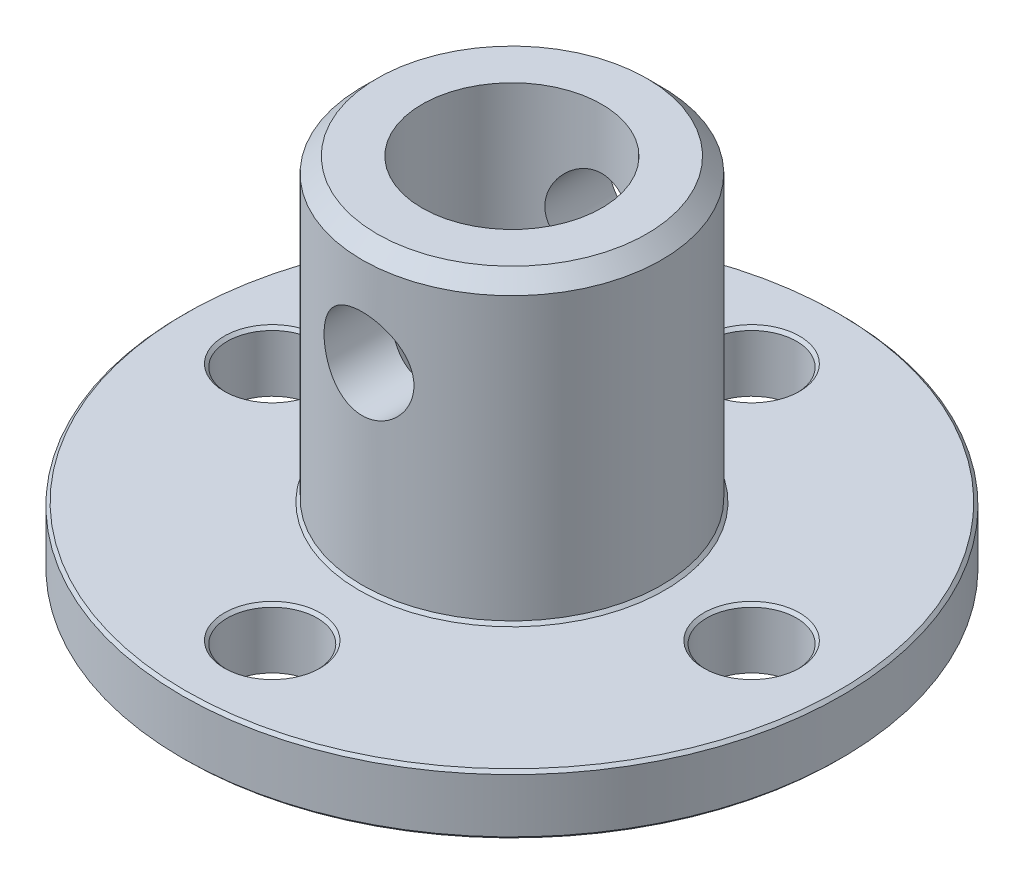
ISO-10303-21;
HEADER;
FILE_DESCRIPTION(('STEP AP214'),'2;1');
FILE_NAME('part.step','',(''),(''),'','','');
FILE_SCHEMA(('AUTOMOTIVE_DESIGN { 1 0 10303 214 1 1 1 1 }'));
ENDSEC;
DATA;
#1=APPLICATION_CONTEXT('core data for automotive mechanical design processes');
#2=APPLICATION_PROTOCOL_DEFINITION('international standard','automotive_design',2000,#1);
#3=PRODUCT_CONTEXT('',#1,'mechanical');
#4=PRODUCT('Part','Part','',(#3));
#5=PRODUCT_RELATED_PRODUCT_CATEGORY('part','',(#4));
#6=PRODUCT_DEFINITION_FORMATION('','',#4);
#7=PRODUCT_DEFINITION_CONTEXT('part definition',#1,'design');
#8=PRODUCT_DEFINITION('design','',#6,#7);
#9=PRODUCT_DEFINITION_SHAPE('','',#8);
#10=(LENGTH_UNIT() NAMED_UNIT(*) SI_UNIT(.MILLI.,.METRE.));
#11=(NAMED_UNIT(*) PLANE_ANGLE_UNIT() SI_UNIT($,.RADIAN.));
#12=(NAMED_UNIT(*) SI_UNIT($,.STERADIAN.) SOLID_ANGLE_UNIT());
#13=UNCERTAINTY_MEASURE_WITH_UNIT(LENGTH_MEASURE(1.E-05),#10,'distance_accuracy_value','');
#14=(GEOMETRIC_REPRESENTATION_CONTEXT(3) GLOBAL_UNCERTAINTY_ASSIGNED_CONTEXT((#13)) GLOBAL_UNIT_ASSIGNED_CONTEXT((#10,
#11,#12)) REPRESENTATION_CONTEXT('',''));
#15=CARTESIAN_POINT('',(0.,0.,0.));
#16=DIRECTION('',(0.,0.,1.));
#17=DIRECTION('',(1.,0.,0.));
#18=AXIS2_PLACEMENT_3D('',#15,#16,#17);
#19=CARTESIAN_POINT('',(8.,2.,0.));
#20=DIRECTION('',(0.,-1.,0.));
#21=DIRECTION('',(0.,0.,-1.));
#22=AXIS2_PLACEMENT_3D('',#19,#20,#21);
#23=CYLINDRICAL_SURFACE('',#22,1.50000000000003);
#24=CARTESIAN_POINT('',(8.,1.90000000000001,0.));
#25=DIRECTION('',(0.,1.,0.));
#26=DIRECTION('',(0.,0.,1.));
#27=AXIS2_PLACEMENT_3D('',#24,#25,#26);
#28=CIRCLE('',#27,1.50000000000003);
#29=CARTESIAN_POINT('',(8.,1.90000000000001,1.50000000000003));
#30=VERTEX_POINT('',#29);
#31=EDGE_CURVE('E167',#30,#30,#28,.T.);
#32=ORIENTED_EDGE('',*,*,#31,.T.);
#33=EDGE_LOOP('',(#32));
#34=FACE_BOUND('',#33,.T.);
#35=CARTESIAN_POINT('',(8.,0.,0.));
#36=DIRECTION('',(0.,1.,0.));
#37=DIRECTION('',(0.,0.,1.));
#38=AXIS2_PLACEMENT_3D('',#35,#36,#37);
#39=CIRCLE('',#38,1.50000000000003);
#40=CARTESIAN_POINT('',(8.,0.,1.50000000000003));
#41=VERTEX_POINT('',#40);
#42=EDGE_CURVE('E170',#41,#41,#39,.T.);
#43=ORIENTED_EDGE('',*,*,#42,.F.);
#44=EDGE_LOOP('',(#43));
#45=FACE_BOUND('',#44,.T.);
#46=ADVANCED_FACE('F33',(#34,#45),#23,.F.);
#47=CARTESIAN_POINT('',(0.,2.,0.));
#48=DIRECTION('',(0.,-1.,0.));
#49=DIRECTION('',(0.,0.,-1.));
#50=AXIS2_PLACEMENT_3D('',#47,#48,#49);
#51=CYLINDRICAL_SURFACE('',#50,3.);
#52=CARTESIAN_POINT('',(0.,10.,-3.));
#53=CARTESIAN_POINT('',(-0.0788579444268503,9.99999504652421,-2.99999570107562));
#54=CARTESIAN_POINT('',(-0.157809899546344,9.99374489031842,-2.99685736529635));
#55=CARTESIAN_POINT('',(-0.313380352903344,9.96902067948769,-2.98461234055736));
#56=CARTESIAN_POINT('',(-0.389994130070444,9.95052341050328,-2.97549431743379));
#57=CARTESIAN_POINT('',(-0.538400317320673,9.90220928707506,-2.95224419105063));
#58=CARTESIAN_POINT('',(-0.610210204408719,9.87243642362805,-2.93813158766306));
#59=CARTESIAN_POINT('',(-0.747708925209898,9.80264406795252,-2.90618664773642));
#60=CARTESIAN_POINT('',(-0.813398240985089,9.7626253836267,-2.88835460450288));
#61=CARTESIAN_POINT('',(-0.941261726642864,9.67072412577207,-2.84934387387093));
#62=CARTESIAN_POINT('',(-1.00298281668316,9.61827028114054,-2.82802798691306));
#63=CARTESIAN_POINT('',(-1.11716916730047,9.50421778112944,-2.78489955370115));
#64=CARTESIAN_POINT('',(-1.16962737466015,9.44261222234134,-2.76308664313552));
#65=CARTESIAN_POINT('',(-1.26787800067542,9.30627497571493,-2.71948426796021));
#66=CARTESIAN_POINT('',(-1.31283800332746,9.23089585248113,-2.69782780455198));
#67=CARTESIAN_POINT('',(-1.38925234033604,9.07244899602068,-2.65928968158481));
#68=CARTESIAN_POINT('',(-1.4207163224495,8.98938680691588,-2.64240461410484));
#69=CARTESIAN_POINT('',(-1.46719866328288,8.82300234186712,-2.61686800556713));
#70=CARTESIAN_POINT('',(-1.48308878562066,8.73999332189891,-2.6077840737557));
#71=CARTESIAN_POINT('',(-1.50064048996327,8.57203174333078,-2.59772834922792));
#72=CARTESIAN_POINT('',(-1.50231613255961,8.48708118869327,-2.59674854014932));
#73=CARTESIAN_POINT('',(-1.49203093075844,8.32857096352695,-2.60266395385873));
#74=CARTESIAN_POINT('',(-1.48167683930523,8.25486395316543,-2.6086314549302));
#75=CARTESIAN_POINT('',(-1.4504097735854,8.11041713594044,-2.62614343100775));
#76=CARTESIAN_POINT('',(-1.42949343584648,8.03967828204203,-2.63768968247664));
#77=CARTESIAN_POINT('',(-1.37731467057901,7.90115630115151,-2.66531214619112));
#78=CARTESIAN_POINT('',(-1.34582260067399,7.83348040182132,-2.68148760995998));
#79=CARTESIAN_POINT('',(-1.273562531502,7.70404856111499,-2.71655106422106));
#80=CARTESIAN_POINT('',(-1.2327903657187,7.64229529659987,-2.73544027170286));
#81=CARTESIAN_POINT('',(-1.13709908236918,7.51821812088516,-2.77669736854929));
#82=CARTESIAN_POINT('',(-1.08104168755392,7.45681468963576,-2.79920265355119));
#83=CARTESIAN_POINT('',(-0.95933336811206,7.34389687211365,-2.84321434950611));
#84=CARTESIAN_POINT('',(-0.893677884861429,7.29238721194918,-2.86472027938201));
#85=CARTESIAN_POINT('',(-0.750774758747773,7.19847150845541,-2.90552980924446));
#86=CARTESIAN_POINT('',(-0.673130387399114,7.15659929133139,-2.92468476243011));
#87=CARTESIAN_POINT('',(-0.510699323233196,7.08685445643549,-2.95736821681863));
#88=CARTESIAN_POINT('',(-0.425918364397914,7.05897072247725,-2.9709011841533));
#89=CARTESIAN_POINT('',(-0.259149737491054,7.02028689442499,-2.98986500612153));
#90=CARTESIAN_POINT('',(-0.17751229582249,7.00826314637983,-2.99587407451965));
#91=CARTESIAN_POINT('',(-0.0131693999240282,6.99780290329827,-3.00109520188655));
#92=CARTESIAN_POINT('',(0.0695355298048624,6.9993599715408,-3.00031048081978));
#93=CARTESIAN_POINT('',(0.22684945797898,7.01531003262812,-2.99236788380152));
#94=CARTESIAN_POINT('',(0.301589112074894,7.02869879909499,-2.98570868532253));
#95=CARTESIAN_POINT('',(0.447610338452911,7.06635710784268,-2.9673325697226));
#96=CARTESIAN_POINT('',(0.51889152853663,7.09062784968024,-2.95561509501618));
#97=CARTESIAN_POINT('',(0.658332912674358,7.14999769964955,-2.92776377120382));
#98=CARTESIAN_POINT('',(0.726345595508704,7.18538657517443,-2.91151322654446));
#99=CARTESIAN_POINT('',(0.855692042548906,7.26566130346985,-2.87615961476126));
#100=CARTESIAN_POINT('',(0.917022944664886,7.31055120189309,-2.85705533350407));
#101=CARTESIAN_POINT('',(1.03765153393382,7.41364063799607,-2.81562332004297));
#102=CARTESIAN_POINT('',(1.09615811672854,7.47271430266772,-2.79316327265249));
#103=CARTESIAN_POINT('',(1.20278448167828,7.59988772691659,-2.7489358741323));
#104=CARTESIAN_POINT('',(1.25089707856781,7.66799367827188,-2.72716901100071));
#105=CARTESIAN_POINT('',(1.33756187171853,7.81546548125946,-2.68576788309734));
#106=CARTESIAN_POINT('',(1.37553824370037,7.89521689914172,-2.66628794383591));
#107=CARTESIAN_POINT('',(1.43712423890206,8.06126510136245,-2.63361108441202));
#108=CARTESIAN_POINT('',(1.46075237380052,8.14755328970034,-2.62040607332625));
#109=CARTESIAN_POINT('',(1.49079253120031,8.31536533432705,-2.60342251538703));
#110=CARTESIAN_POINT('',(1.49863949460818,8.39655138015286,-2.59886075197597));
#111=CARTESIAN_POINT('',(1.5010337315643,8.55917060074679,-2.59748031962405));
#112=CARTESIAN_POINT('',(1.49558676993486,8.64060365310679,-2.60065829439585));
#113=CARTESIAN_POINT('',(1.47288918838996,8.79322525230016,-2.61356793076615));
#114=CARTESIAN_POINT('',(1.45681247151455,8.86465070521711,-2.62264641723988));
#115=CARTESIAN_POINT('',(1.41476303733662,9.00371217913655,-2.64556524281479));
#116=CARTESIAN_POINT('',(1.38878713673988,9.07134697313805,-2.65940711354503));
#117=CARTESIAN_POINT('',(1.32572361795085,9.2059372764798,-2.69142795546803));
#118=CARTESIAN_POINT('',(1.28800670672355,9.27254185274354,-2.70983583593881));
#119=CARTESIAN_POINT('',(1.20322645745609,9.39891180427188,-2.74852997452291));
#120=CARTESIAN_POINT('',(1.15615825686234,9.45867359578167,-2.76881720693416));
#121=CARTESIAN_POINT('',(1.04730498999206,9.57721297353201,-2.81193484737138));
#122=CARTESIAN_POINT('',(0.984426634495893,9.63498865352544,-2.83477474959942));
#123=CARTESIAN_POINT('',(0.849232209349796,9.7393944751529,-2.87816628389896));
#124=CARTESIAN_POINT('',(0.776911084957796,9.78601860920486,-2.89871667939293));
#125=CARTESIAN_POINT('',(0.623897395174418,9.86685454406811,-2.93547014349806));
#126=CARTESIAN_POINT('',(0.543149255665096,9.9009762538547,-2.95164144740899));
#127=CARTESIAN_POINT('',(0.37611315170713,9.95471225163611,-2.9775201194848));
#128=CARTESIAN_POINT('',(0.28984169938365,9.97436777020857,-2.98724585044602));
#129=CARTESIAN_POINT('',(0.168902919736343,9.99084611662861,-2.99543192870217));
#130=CARTESIAN_POINT('',(0.135242819162348,9.99427396129951,-2.99714048010376));
#131=CARTESIAN_POINT('',(0.0677275977076381,9.99885199827113,-2.99942545465223));
#132=CARTESIAN_POINT('',(0.033872471469943,10.0000021277053,-3.00000184655071));
#133=CARTESIAN_POINT('',(0.,10.,-3.));
#134=B_SPLINE_CURVE_WITH_KNOTS('',3,(#52,#53,#54,#55,#56,#57,#58,#59,#60,#61,#62,#63,#64,#65,
#66,#67,#68,#69,#70,#71,#72,#73,#74,#75,#76,#77,#78,#79,#80,#81,#82,#83,#84,#85,#86,#87,#88,#89,
#90,#91,#92,#93,#94,#95,#96,#97,#98,#99,#100,#101,#102,#103,#104,#105,#106,#107,#108,#109,#110,
#111,#112,#113,#114,#115,#116,#117,#118,#119,#120,#121,#122,#123,#124,#125,#126,#127,#128,#129,
#130,#131,#132,#133),.UNSPECIFIED.,.T.,.F.,(4,2,2,2,2,2,2,2,2,2,2,2,2,2,2,2,2,2,2,2,2,2,2,2,2,2,
2,2,2,2,2,2,2,2,2,2,2,2,2,2,4),(0.,0.236436386130439,0.473322224563796,0.709293233238448,
0.945245640872352,1.19547263807713,1.44588935648105,1.71572589646129,1.98536921847421,
2.23887018210344,2.49212035993531,2.71508568613981,2.93812205888517,3.16635360252731,
3.39468781890333,3.65197412000818,3.90938301898029,4.17874533321661,4.44789325368419,
4.69474935707018,4.94148846767214,5.16910359759183,5.39674382446397,5.63089284041848,
5.86514176122509,6.12239415966628,6.37982382923148,6.64972023242588,6.91926767918176,
7.1629396125457,7.40650589797018,7.62686895373283,7.84730293182526,8.0825468517043,
8.31791341715446,8.58187864135757,8.84598575071869,9.1119602049529,9.37717362931724,
9.47872920200875,9.58028757766599),.UNSPECIFIED.);
#135=CARTESIAN_POINT('',(0.,10.,-3.));
#136=VERTEX_POINT('',#135);
#137=EDGE_CURVE('E81',#136,#136,#134,.T.);
#138=ORIENTED_EDGE('',*,*,#137,.F.);
#139=EDGE_LOOP('',(#138));
#140=FACE_BOUND('',#139,.T.);
#141=CARTESIAN_POINT('',(1.5,8.5,2.59807621135332));
#142=CARTESIAN_POINT('',(1.4999945446118,8.42183828770712,2.59808302092689));
#143=CARTESIAN_POINT('',(1.49384995609983,8.34357788271243,2.60165701781635));
#144=CARTESIAN_POINT('',(1.46958481484708,8.18945910298427,2.61543549678079));
#145=CARTESIAN_POINT('',(1.45143909683127,8.11360612743489,2.62565391083339));
#146=CARTESIAN_POINT('',(1.40414992304972,7.96682250348409,2.65124019908098));
#147=CARTESIAN_POINT('',(1.3750649287406,7.89586802128962,2.66658065209878));
#148=CARTESIAN_POINT('',(1.30690128806456,7.75986369700492,2.70063997225287));
#149=CARTESIAN_POINT('',(1.26782210105366,7.69481417460631,2.71935902214097));
#150=CARTESIAN_POINT('',(1.17699981079632,7.56654140716374,2.75995303586162));
#151=CARTESIAN_POINT('',(1.12447805421566,7.50391129648969,2.7819609545693));
#152=CARTESIAN_POINT('',(1.0098807114217,7.38788741738994,2.82557974178559));
#153=CARTESIAN_POINT('',(0.94780038867344,7.33449825612472,2.84719040746875));
#154=CARTESIAN_POINT('',(0.810734345121819,7.23494927327851,2.88932215429424));
#155=CARTESIAN_POINT('',(0.735160783518862,7.18951934821071,2.90967159627259));
#156=CARTESIAN_POINT('',(0.576235539899256,7.11228872013136,2.94526134149294));
#157=CARTESIAN_POINT('',(0.492888807207232,7.08047941579424,2.96050486775612));
#158=CARTESIAN_POINT('',(0.327067415888965,7.03374300804836,2.98320691866356));
#159=CARTESIAN_POINT('',(0.244952685733226,7.0177757104667,2.99114220331338));
#160=CARTESIAN_POINT('',(0.0788559430467718,6.99975082198744,3.00011375769101));
#161=CARTESIAN_POINT('',(-0.00512490876560819,6.99768481480643,3.00115420176885));
#162=CARTESIAN_POINT('',(-0.164748786635626,7.00712001095552,2.99644472874675));
#163=CARTESIAN_POINT('',(-0.240481798765188,7.01745702328183,2.99127743838241));
#164=CARTESIAN_POINT('',(-0.388970657877484,7.04932126585699,2.97561367889621));
#165=CARTESIAN_POINT('',(-0.461726281640889,7.07084933346434,2.96511681099591));
#166=CARTESIAN_POINT('',(-0.603464087354331,7.12462384913472,2.93957374931482));
#167=CARTESIAN_POINT('',(-0.672380135272768,7.1570144697581,2.92446662293799));
#168=CARTESIAN_POINT('',(-0.803965202269994,7.23139512430224,2.89106468980031));
#169=CARTESIAN_POINT('',(-0.866631973257969,7.27338859495353,2.87276874236226));
#170=CARTESIAN_POINT('',(-0.990260491347293,7.37034302729952,2.83266591598844));
#171=CARTESIAN_POINT('',(-1.05050111254404,7.42615454248902,2.81069063997263));
#172=CARTESIAN_POINT('',(-1.16115655544667,7.54688458739527,2.76681510880217));
#173=CARTESIAN_POINT('',(-1.21156381736135,7.61181005841109,2.74491492398443));
#174=CARTESIAN_POINT('',(-1.30425800196332,7.75397228863613,2.70216234138727));
#175=CARTESIAN_POINT('',(-1.34582597246708,7.83172903458132,2.68146479986061));
#176=CARTESIAN_POINT('',(-1.41497866950185,7.9944065070385,2.64563175417864));
#177=CARTESIAN_POINT('',(-1.44257798731633,8.07931964952634,2.63049045069101));
#178=CARTESIAN_POINT('',(-1.48077031653756,8.24682176692419,2.60916953725552));
#179=CARTESIAN_POINT('',(-1.49253768317996,8.32906167856533,2.60237483772745));
#180=CARTESIAN_POINT('',(-1.50227541991714,8.49460201227481,2.59676879042414));
#181=CARTESIAN_POINT('',(-1.50025553597254,8.57790164367968,2.59795180333967));
#182=CARTESIAN_POINT('',(-1.48355406501595,8.73348087786809,2.60751504810877));
#183=CARTESIAN_POINT('',(-1.4702817250687,8.80596917666189,2.61509381259981));
#184=CARTESIAN_POINT('',(-1.43354442694866,8.94755167940644,2.63541032327012));
#185=CARTESIAN_POINT('',(-1.41007616793542,9.01664477611991,2.64814974007551));
#186=CARTESIAN_POINT('',(-1.35247138290733,9.15311699635404,2.67804333119485));
#187=CARTESIAN_POINT('',(-1.31789109553908,9.22026852528033,2.69537464864595));
#188=CARTESIAN_POINT('',(-1.23943059602371,9.34820390730849,2.73234179245875));
#189=CARTESIAN_POINT('',(-1.19554560649832,9.40898446526993,2.75197880032721));
#190=CARTESIAN_POINT('',(-1.09325575079828,9.53046815128532,2.79431997684504));
#191=CARTESIAN_POINT('',(-1.03371790847245,9.59019572607649,2.81709874731434));
#192=CARTESIAN_POINT('',(-0.905106743097431,9.69911835699039,2.86101352466839));
#193=CARTESIAN_POINT('',(-0.83603021198302,9.74830985534581,2.88214897511564));
#194=CARTESIAN_POINT('',(-0.687803043838135,9.83586058892515,2.92112042536435));
#195=CARTESIAN_POINT('',(-0.608434646361169,9.87389967731637,2.93885462508044));
#196=CARTESIAN_POINT('',(-0.443283546961622,9.93570685578609,2.96825032438952));
#197=CARTESIAN_POINT('',(-0.357506552088263,9.95948747704946,2.9799171551456));
#198=CARTESIAN_POINT('',(-0.190469523495625,9.99005284626199,2.99501262272824));
#199=CARTESIAN_POINT('',(-0.109517165775685,9.99819681381417,2.99909891862287));
#200=CARTESIAN_POINT('',(0.0526889789268063,10.0012648981816,3.00063195562697));
#201=CARTESIAN_POINT('',(0.133942650442631,9.99619364278535,2.99808102100335));
#202=CARTESIAN_POINT('',(0.288806988475722,9.97387538980657,2.98700953256884));
#203=CARTESIAN_POINT('',(0.362568476716897,9.95745272611349,2.97889342001985));
#204=CARTESIAN_POINT('',(0.506168928275427,9.91400950104554,2.95788140495135));
#205=CARTESIAN_POINT('',(0.576007327433264,9.88698741985982,2.94498481699194));
#206=CARTESIAN_POINT('',(0.713135109367327,9.82190942175104,2.9148889612218));
#207=CARTESIAN_POINT('',(0.78018771405007,9.78343101518824,2.89752925798199));
#208=CARTESIAN_POINT('',(0.907161962721038,9.69706310371143,2.86032199712739));
#209=CARTESIAN_POINT('',(0.967080311122361,9.64916927632649,2.84047329837541));
#210=CARTESIAN_POINT('',(1.08437100623534,9.53980429146595,2.79792915339941));
#211=CARTESIAN_POINT('',(1.14089652680891,9.47745626878421,2.77514698517547));
#212=CARTESIAN_POINT('',(1.24299493109201,9.34382391830535,2.73094614244278));
#213=CARTESIAN_POINT('',(1.28855812501509,9.27253176869847,2.70952868642798));
#214=CARTESIAN_POINT('',(1.36864661967848,9.12004503012857,2.66999407957374));
#215=CARTESIAN_POINT('',(1.40277759894141,9.0386087033069,2.65200261384405));
#216=CARTESIAN_POINT('',(1.45631806425962,8.87000139349033,2.62299234492527));
#217=CARTESIAN_POINT('',(1.47577678676302,8.78285066663097,2.61195024221553));
#218=CARTESIAN_POINT('',(1.49155051179662,8.662291966522,2.60293908902686));
#219=CARTESIAN_POINT('',(1.49471415744578,8.62994815840317,2.60112193507728));
#220=CARTESIAN_POINT('',(1.49894010763494,8.56507527897664,2.59868903831625));
#221=CARTESIAN_POINT('',(1.50000227159981,8.53254619542119,2.59807337587664));
#222=CARTESIAN_POINT('',(1.5,8.5,2.59807621135332));
#223=B_SPLINE_CURVE_WITH_KNOTS('',3,(#141,#142,#143,#144,#145,#146,#147,#148,#149,#150,#151,
#152,#153,#154,#155,#156,#157,#158,#159,#160,#161,#162,#163,#164,#165,#166,#167,#168,#169,#170,
#171,#172,#173,#174,#175,#176,#177,#178,#179,#180,#181,#182,#183,#184,#185,#186,#187,#188,#189,
#190,#191,#192,#193,#194,#195,#196,#197,#198,#199,#200,#201,#202,#203,#204,#205,#206,#207,#208,
#209,#210,#211,#212,#213,#214,#215,#216,#217,#218,#219,#220,#221,#222),.UNSPECIFIED.,.T.,.F.,(4,
2,2,2,2,2,2,2,2,2,2,2,2,2,2,2,2,2,2,2,2,2,2,2,2,2,2,2,2,2,2,2,2,2,2,2,2,2,2,2,4),(0.,
0.234348183892073,0.469189339237207,0.702792893878329,0.936409088167726,1.18929346874735,
1.44230356626556,1.71236838358145,1.98226240445837,2.23295227451903,2.4834903552906,
2.71224146226808,2.94100968776183,3.1729430209672,3.40495949025408,3.65890787185336,
3.91305072368878,4.18333262594173,4.45333161317557,4.70193436281318,4.9503613978256,
5.17161275136038,5.39293578654095,5.62450944609131,5.85620229330071,6.1171011537092,
6.37808797467303,6.64596272119449,6.91360169713157,7.1566840558423,7.39968130190958,
7.62666637307239,7.8536840026802,8.09041126079208,8.32724745151079,8.58765362775102,
8.84828914267732,9.11716123557908,9.38512699504141,9.48270202777964,9.58028358741811),.UNSPECIFIED.);
#224=CARTESIAN_POINT('',(1.5,8.5,2.59807621135332));
#225=VERTEX_POINT('',#224);
#226=EDGE_CURVE('E75',#225,#225,#223,.T.);
#227=ORIENTED_EDGE('',*,*,#226,.F.);
#228=EDGE_LOOP('',(#227));
#229=FACE_BOUND('',#228,.T.);
#230=CARTESIAN_POINT('',(0.,0.,0.));
#231=DIRECTION('',(0.,1.,0.));
#232=DIRECTION('',(0.,0.,1.));
#233=AXIS2_PLACEMENT_3D('',#230,#231,#232);
#234=CIRCLE('',#233,3.);
#235=CARTESIAN_POINT('',(0.,0.,3.));
#236=VERTEX_POINT('',#235);
#237=EDGE_CURVE('E173',#236,#236,#234,.T.);
#238=ORIENTED_EDGE('',*,*,#237,.F.);
#239=EDGE_LOOP('',(#238));
#240=FACE_BOUND('',#239,.T.);
#241=CARTESIAN_POINT('',(0.,12.,0.));
#242=DIRECTION('',(0.,1.,0.));
#243=DIRECTION('',(0.,0.,1.));
#244=AXIS2_PLACEMENT_3D('',#241,#242,#243);
#245=CIRCLE('',#244,3.);
#246=CARTESIAN_POINT('',(0.,12.,3.));
#247=VERTEX_POINT('',#246);
#248=EDGE_CURVE('E232',#247,#247,#245,.F.);
#249=ORIENTED_EDGE('',*,*,#248,.F.);
#250=EDGE_LOOP('',(#249));
#251=FACE_BOUND('',#250,.T.);
#252=ADVANCED_FACE('F86',(#140,#229,#240,#251),#51,.F.);
#253=CARTESIAN_POINT('',(-8.,2.,0.));
#254=DIRECTION('',(0.,-1.,0.));
#255=DIRECTION('',(0.,0.,-1.));
#256=AXIS2_PLACEMENT_3D('',#253,#254,#255);
#257=CYLINDRICAL_SURFACE('',#256,1.50000000000008);
#258=CARTESIAN_POINT('',(-8.,1.9,0.));
#259=DIRECTION('',(0.,1.,0.));
#260=DIRECTION('',(0.,0.,1.));
#261=AXIS2_PLACEMENT_3D('',#258,#259,#260);
#262=CIRCLE('',#261,1.50000000000008);
#263=CARTESIAN_POINT('',(-8.,1.9,1.50000000000008));
#264=VERTEX_POINT('',#263);
#265=EDGE_CURVE('E210',#264,#264,#262,.T.);
#266=ORIENTED_EDGE('',*,*,#265,.T.);
#267=EDGE_LOOP('',(#266));
#268=FACE_BOUND('',#267,.T.);
#269=CARTESIAN_POINT('',(-8.,0.,0.));
#270=DIRECTION('',(0.,1.,0.));
#271=DIRECTION('',(0.,0.,1.));
#272=AXIS2_PLACEMENT_3D('',#269,#270,#271);
#273=CIRCLE('',#272,1.50000000000008);
#274=CARTESIAN_POINT('',(-8.,0.,1.50000000000008));
#275=VERTEX_POINT('',#274);
#276=EDGE_CURVE('E179',#275,#275,#273,.T.);
#277=ORIENTED_EDGE('',*,*,#276,.F.);
#278=EDGE_LOOP('',(#277));
#279=FACE_BOUND('',#278,.T.);
#280=ADVANCED_FACE('F91',(#268,#279),#257,.F.);
#281=CARTESIAN_POINT('',(0.,2.,8.));
#282=DIRECTION('',(0.,-1.,0.));
#283=DIRECTION('',(0.,0.,-1.));
#284=AXIS2_PLACEMENT_3D('',#281,#282,#283);
#285=CYLINDRICAL_SURFACE('',#284,1.50000000000006);
#286=CARTESIAN_POINT('',(0.,1.9,8.));
#287=DIRECTION('',(0.,1.,0.));
#288=DIRECTION('',(0.,0.,1.));
#289=AXIS2_PLACEMENT_3D('',#286,#287,#288);
#290=CIRCLE('',#289,1.50000000000006);
#291=CARTESIAN_POINT('',(0.,1.9,9.50000000000006));
#292=VERTEX_POINT('',#291);
#293=EDGE_CURVE('E213',#292,#292,#290,.T.);
#294=ORIENTED_EDGE('',*,*,#293,.T.);
#295=EDGE_LOOP('',(#294));
#296=FACE_BOUND('',#295,.T.);
#297=CARTESIAN_POINT('',(0.,0.,8.));
#298=DIRECTION('',(0.,1.,0.));
#299=DIRECTION('',(0.,0.,1.));
#300=AXIS2_PLACEMENT_3D('',#297,#298,#299);
#301=CIRCLE('',#300,1.50000000000006);
#302=CARTESIAN_POINT('',(0.,0.,9.50000000000006));
#303=VERTEX_POINT('',#302);
#304=EDGE_CURVE('E236',#303,#303,#301,.T.);
#305=ORIENTED_EDGE('',*,*,#304,.F.);
#306=EDGE_LOOP('',(#305));
#307=FACE_BOUND('',#306,.T.);
#308=ADVANCED_FACE('F97',(#296,#307),#285,.F.);
#309=CARTESIAN_POINT('',(0.,2.,-8.));
#310=DIRECTION('',(0.,-1.,0.));
#311=DIRECTION('',(0.,0.,-1.));
#312=AXIS2_PLACEMENT_3D('',#309,#310,#311);
#313=CYLINDRICAL_SURFACE('',#312,1.5);
#314=CARTESIAN_POINT('',(0.,1.9,-8.));
#315=DIRECTION('',(0.,1.,0.));
#316=DIRECTION('',(0.,0.,1.));
#317=AXIS2_PLACEMENT_3D('',#314,#315,#316);
#318=CIRCLE('',#317,1.5);
#319=CARTESIAN_POINT('',(0.,1.9,-6.5));
#320=VERTEX_POINT('',#319);
#321=EDGE_CURVE('E216',#320,#320,#318,.T.);
#322=ORIENTED_EDGE('',*,*,#321,.T.);
#323=EDGE_LOOP('',(#322));
#324=FACE_BOUND('',#323,.T.);
#325=CARTESIAN_POINT('',(0.,0.,-8.));
#326=DIRECTION('',(0.,1.,0.));
#327=DIRECTION('',(0.,0.,1.));
#328=AXIS2_PLACEMENT_3D('',#325,#326,#327);
#329=CIRCLE('',#328,1.5);
#330=CARTESIAN_POINT('',(0.,0.,-6.5));
#331=VERTEX_POINT('',#330);
#332=EDGE_CURVE('E234',#331,#331,#329,.T.);
#333=ORIENTED_EDGE('',*,*,#332,.F.);
#334=EDGE_LOOP('',(#333));
#335=FACE_BOUND('',#334,.T.);
#336=ADVANCED_FACE('F101',(#324,#335),#313,.F.);
#337=CARTESIAN_POINT('',(0.,2.,0.));
#338=DIRECTION('',(0.,-1.,0.));
#339=DIRECTION('',(0.,0.,-1.));
#340=AXIS2_PLACEMENT_3D('',#337,#338,#339);
#341=CYLINDRICAL_SURFACE('',#340,11.);
#342=CARTESIAN_POINT('',(0.,1.9,0.));
#343=DIRECTION('',(0.,1.,0.));
#344=DIRECTION('',(0.,0.,1.));
#345=AXIS2_PLACEMENT_3D('',#342,#343,#344);
#346=CIRCLE('',#345,11.);
#347=CARTESIAN_POINT('',(0.,1.9,11.));
#348=VERTEX_POINT('',#347);
#349=EDGE_CURVE('E206',#348,#348,#346,.F.);
#350=ORIENTED_EDGE('',*,*,#349,.T.);
#351=EDGE_LOOP('',(#350));
#352=FACE_BOUND('',#351,.T.);
#353=CARTESIAN_POINT('',(0.,0.0999999999999977,0.));
#354=DIRECTION('',(0.,1.,0.));
#355=DIRECTION('',(0.,0.,1.));
#356=AXIS2_PLACEMENT_3D('',#353,#354,#355);
#357=CIRCLE('',#356,11.);
#358=CARTESIAN_POINT('',(0.,0.0999999999999977,11.));
#359=VERTEX_POINT('',#358);
#360=EDGE_CURVE('E203',#359,#359,#357,.T.);
#361=ORIENTED_EDGE('',*,*,#360,.T.);
#362=EDGE_LOOP('',(#361));
#363=FACE_BOUND('',#362,.T.);
#364=ADVANCED_FACE('F105',(#352,#363),#341,.T.);
#365=CARTESIAN_POINT('',(0.,2.,0.));
#366=DIRECTION('',(0.,1.,0.));
#367=DIRECTION('',(0.,0.,1.));
#368=AXIS2_PLACEMENT_3D('',#365,#366,#367);
#369=PLANE('',#368);
#370=CARTESIAN_POINT('',(0.,2.,0.));
#371=DIRECTION('',(0.,1.,0.));
#372=DIRECTION('',(0.,0.,1.));
#373=AXIS2_PLACEMENT_3D('',#370,#371,#372);
#374=CIRCLE('',#373,10.9);
#375=CARTESIAN_POINT('',(0.,2.,10.9));
#376=VERTEX_POINT('',#375);
#377=EDGE_CURVE('E200',#376,#376,#374,.T.);
#378=ORIENTED_EDGE('',*,*,#377,.T.);
#379=EDGE_LOOP('',(#378));
#380=FACE_BOUND('',#379,.T.);
#381=CARTESIAN_POINT('',(8.,2.,0.));
#382=DIRECTION('',(0.,1.,0.));
#383=DIRECTION('',(0.,0.,1.));
#384=AXIS2_PLACEMENT_3D('',#381,#382,#383);
#385=CIRCLE('',#384,1.60000000000002);
#386=CARTESIAN_POINT('',(8.,2.,1.60000000000002));
#387=VERTEX_POINT('',#386);
#388=EDGE_CURVE('E197',#387,#387,#385,.F.);
#389=ORIENTED_EDGE('',*,*,#388,.T.);
#390=EDGE_LOOP('',(#389));
#391=FACE_BOUND('',#390,.T.);
#392=CARTESIAN_POINT('',(-8.,2.,0.));
#393=DIRECTION('',(0.,1.,0.));
#394=DIRECTION('',(0.,0.,1.));
#395=AXIS2_PLACEMENT_3D('',#392,#393,#394);
#396=CIRCLE('',#395,1.60000000000008);
#397=CARTESIAN_POINT('',(-8.,2.,1.60000000000008));
#398=VERTEX_POINT('',#397);
#399=EDGE_CURVE('E194',#398,#398,#396,.F.);
#400=ORIENTED_EDGE('',*,*,#399,.T.);
#401=EDGE_LOOP('',(#400));
#402=FACE_BOUND('',#401,.T.);
#403=CARTESIAN_POINT('',(0.,2.,8.));
#404=DIRECTION('',(0.,1.,0.));
#405=DIRECTION('',(0.,0.,1.));
#406=AXIS2_PLACEMENT_3D('',#403,#404,#405);
#407=CIRCLE('',#406,1.60000000000006);
#408=CARTESIAN_POINT('',(0.,2.,9.60000000000006));
#409=VERTEX_POINT('',#408);
#410=EDGE_CURVE('E191',#409,#409,#407,.F.);
#411=ORIENTED_EDGE('',*,*,#410,.T.);
#412=EDGE_LOOP('',(#411));
#413=FACE_BOUND('',#412,.T.);
#414=CARTESIAN_POINT('',(0.,2.,-8.));
#415=DIRECTION('',(0.,1.,0.));
#416=DIRECTION('',(0.,0.,1.));
#417=AXIS2_PLACEMENT_3D('',#414,#415,#416);
#418=CIRCLE('',#417,1.6);
#419=CARTESIAN_POINT('',(0.,2.,-6.4));
#420=VERTEX_POINT('',#419);
#421=EDGE_CURVE('E188',#420,#420,#418,.F.);
#422=ORIENTED_EDGE('',*,*,#421,.T.);
#423=EDGE_LOOP('',(#422));
#424=FACE_BOUND('',#423,.T.);
#425=CARTESIAN_POINT('',(0.,2.,0.));
#426=DIRECTION('',(0.,1.,0.));
#427=DIRECTION('',(0.,0.,1.));
#428=AXIS2_PLACEMENT_3D('',#425,#426,#427);
#429=CIRCLE('',#428,5.10000000000001);
#430=CARTESIAN_POINT('',(0.,2.,5.10000000000001));
#431=VERTEX_POINT('',#430);
#432=EDGE_CURVE('E185',#431,#431,#429,.F.);
#433=ORIENTED_EDGE('',*,*,#432,.T.);
#434=EDGE_LOOP('',(#433));
#435=FACE_BOUND('',#434,.T.);
#436=ADVANCED_FACE('F247',(#380,#391,#402,#413,#424,#435),#369,.T.);
#437=CARTESIAN_POINT('',(0.,0.,0.));
#438=DIRECTION('',(0.,1.,0.));
#439=DIRECTION('',(0.,0.,1.));
#440=AXIS2_PLACEMENT_3D('',#437,#438,#439);
#441=PLANE('',#440);
#442=CARTESIAN_POINT('',(0.,0.,0.));
#443=DIRECTION('',(0.,1.,0.));
#444=DIRECTION('',(0.,0.,1.));
#445=AXIS2_PLACEMENT_3D('',#442,#443,#444);
#446=CIRCLE('',#445,10.9);
#447=CARTESIAN_POINT('',(0.,0.,10.9));
#448=VERTEX_POINT('',#447);
#449=EDGE_CURVE('E50',#448,#448,#446,.F.);
#450=ORIENTED_EDGE('',*,*,#449,.T.);
#451=EDGE_LOOP('',(#450));
#452=FACE_BOUND('',#451,.T.);
#453=ORIENTED_EDGE('',*,*,#332,.T.);
#454=EDGE_LOOP('',(#453));
#455=FACE_BOUND('',#454,.T.);
#456=ORIENTED_EDGE('',*,*,#304,.T.);
#457=EDGE_LOOP('',(#456));
#458=FACE_BOUND('',#457,.T.);
#459=ORIENTED_EDGE('',*,*,#276,.T.);
#460=EDGE_LOOP('',(#459));
#461=FACE_BOUND('',#460,.T.);
#462=ORIENTED_EDGE('',*,*,#237,.T.);
#463=EDGE_LOOP('',(#462));
#464=FACE_BOUND('',#463,.T.);
#465=ORIENTED_EDGE('',*,*,#42,.T.);
#466=EDGE_LOOP('',(#465));
#467=FACE_BOUND('',#466,.T.);
#468=ADVANCED_FACE('F223',(#452,#455,#458,#461,#464,#467),#441,.F.);
#469=CARTESIAN_POINT('',(0.,12.,0.));
#470=DIRECTION('',(0.,-1.,0.));
#471=DIRECTION('',(0.,0.,-1.));
#472=AXIS2_PLACEMENT_3D('',#469,#470,#471);
#473=CYLINDRICAL_SURFACE('',#472,5.);
#474=CARTESIAN_POINT('',(0.,10.,-5.));
#475=CARTESIAN_POINT('',(-0.0822886127533,9.99999900251511,-4.9999992925055));
#476=CARTESIAN_POINT('',(-0.164587318351529,9.99320613637603,-4.99794915693954));
#477=CARTESIAN_POINT('',(-0.326788125304881,9.9662786457779,-4.98997105593691));
#478=CARTESIAN_POINT('',(-0.40668950441142,9.94614004197666,-4.98404193389692));
#479=CARTESIAN_POINT('',(-0.561732707754526,9.89325398308974,-4.96895552501836));
#480=CARTESIAN_POINT('',(-0.636881364395372,9.86052513038107,-4.95980300250425));
#481=CARTESIAN_POINT('',(-0.780624181053131,9.78346390694417,-4.93922109237645));
#482=CARTESIAN_POINT('',(-0.849217467469669,9.73912999260459,-4.92779140192067));
#483=CARTESIAN_POINT('',(-0.979871797183745,9.63877599252733,-4.90350737192774));
#484=CARTESIAN_POINT('',(-1.04171807124434,9.58248337411409,-4.89062383657036));
#485=CARTESIAN_POINT('',(-1.15524920923324,9.46039077008982,-4.86505834210442));
#486=CARTESIAN_POINT('',(-1.20693236327441,9.39458918787504,-4.85237641724501));
#487=CARTESIAN_POINT('',(-1.29980037723708,9.25352924696239,-4.82834113993772));
#488=CARTESIAN_POINT('',(-1.34072309022213,9.17809153900926,-4.81702406663875));
#489=CARTESIAN_POINT('',(-1.4092139477476,9.02101074576971,-4.79743620394031));
#490=CARTESIAN_POINT('',(-1.43678529919973,8.93936915607203,-4.78916468313311));
#491=CARTESIAN_POINT('',(-1.47701633682652,8.77460973386954,-4.77690870838434));
#492=CARTESIAN_POINT('',(-1.49007196234677,8.69159725613606,-4.77281069324533));
#493=CARTESIAN_POINT('',(-1.50213730614672,8.52446684378324,-4.76902789749767));
#494=CARTESIAN_POINT('',(-1.50115042761078,8.44034918194092,-4.76934204760571));
#495=CARTESIAN_POINT('',(-1.48546977199812,8.27661609139152,-4.77424744067778));
#496=CARTESIAN_POINT('',(-1.47127205262685,8.19694774963776,-4.7786838859914));
#497=CARTESIAN_POINT('',(-1.43037420427056,8.04118021372654,-4.79108356228624));
#498=CARTESIAN_POINT('',(-1.40367284141641,7.96508137262567,-4.79904714132351));
#499=CARTESIAN_POINT('',(-1.33816026653682,7.81739965033926,-4.81772733074973));
#500=CARTESIAN_POINT('',(-1.29918816934643,7.74589291604474,-4.82848016115952));
#501=CARTESIAN_POINT('',(-1.21035222588683,7.61026797798981,-4.85150987000064));
#502=CARTESIAN_POINT('',(-1.16048574002588,7.54615157058622,-4.86378711746991));
#503=CARTESIAN_POINT('',(-1.04881290765546,7.42431380923798,-4.88911011297937));
#504=CARTESIAN_POINT('',(-0.986594907466972,7.36697133597033,-4.90216654310498));
#505=CARTESIAN_POINT('',(-0.853263259313967,7.26344601593575,-4.92712244063259));
#506=CARTESIAN_POINT('',(-0.782149051860888,7.21726387158557,-4.9390218351841));
#507=CARTESIAN_POINT('',(-0.632355038342804,7.13714007753527,-4.9604316006947));
#508=CARTESIAN_POINT('',(-0.553627749747951,7.10328248375014,-4.96992543668314));
#509=CARTESIAN_POINT('',(-0.39124541560352,7.04940040990037,-4.98533521832222));
#510=CARTESIAN_POINT('',(-0.307591751589582,7.02937207146751,-4.99125216186999));
#511=CARTESIAN_POINT('',(-0.140952242668332,7.00434782210061,-4.99868364643538));
#512=CARTESIAN_POINT('',(-0.0580500976011879,6.99883841419839,-5.0003485041779));
#513=CARTESIAN_POINT('',(0.107499605823382,7.00156915571208,-4.9995292324176));
#514=CARTESIAN_POINT('',(0.19014719669078,7.00980746965144,-4.99704565677756));
#515=CARTESIAN_POINT('',(0.350903605309696,7.0393846111115,-4.98830696987163));
#516=CARTESIAN_POINT('',(0.429072772614168,7.06042338758087,-4.98213829799417));
#517=CARTESIAN_POINT('',(0.580754638954521,7.1146432327782,-4.96674347841533));
#518=CARTESIAN_POINT('',(0.654266777025583,7.14782576103786,-4.95751696321085));
#519=CARTESIAN_POINT('',(0.796437189461052,7.22625316548113,-4.93669654351325));
#520=CARTESIAN_POINT('',(0.864943826199669,7.27175934094797,-4.92505280829675));
#521=CARTESIAN_POINT('',(0.993523307980147,7.37322475405281,-4.90073468764318));
#522=CARTESIAN_POINT('',(1.05359403235593,7.42918661188767,-4.8880600443108));
#523=CARTESIAN_POINT('',(1.16585744551027,7.55238730836935,-4.86253171869138));
#524=CARTESIAN_POINT('',(1.21768481231504,7.61996187577174,-4.84968825033268));
#525=CARTESIAN_POINT('',(1.30928995072154,7.76312793901353,-4.82576515238463));
#526=CARTESIAN_POINT('',(1.34906803829472,7.83871922455821,-4.81468547654651));
#527=CARTESIAN_POINT('',(1.41517347127168,7.99553249125469,-4.79567189615055));
#528=CARTESIAN_POINT('',(1.4415634693705,8.07672618653659,-4.78772337843827));
#529=CARTESIAN_POINT('',(1.48021730815114,8.24268796893148,-4.77591594362794));
#530=CARTESIAN_POINT('',(1.49248598978779,8.32745482078767,-4.772055625083));
#531=CARTESIAN_POINT('',(1.50221984485059,8.49436151837623,-4.76899972496087));
#532=CARTESIAN_POINT('',(1.5002805530849,8.57646365101759,-4.76961647442754));
#533=CARTESIAN_POINT('',(1.48307505444813,8.7391141033728,-4.77499401288294));
#534=CARTESIAN_POINT('',(1.46780938124716,8.81966248517636,-4.77975463592551));
#535=CARTESIAN_POINT('',(1.42476888804136,8.97594539914285,-4.79275763670386));
#536=CARTESIAN_POINT('',(1.39715175507068,9.05172728736169,-4.80095604545965));
#537=CARTESIAN_POINT('',(1.33031507121129,9.19764243881772,-4.81990278909136));
#538=CARTESIAN_POINT('',(1.29109329962876,9.26777461764076,-4.83065161194312));
#539=CARTESIAN_POINT('',(1.20048763805072,9.40316311652711,-4.85397676425833));
#540=CARTESIAN_POINT('',(1.14871276092994,9.46814876126041,-4.86660540163798));
#541=CARTESIAN_POINT('',(1.03517434629782,9.58870249830786,-4.89201320450026));
#542=CARTESIAN_POINT('',(0.973408217134502,9.64426813946776,-4.90479240823905));
#543=CARTESIAN_POINT('',(0.839465762183249,9.74602341229503,-4.92950936570649));
#544=CARTESIAN_POINT('',(0.767037885790608,9.79189144685549,-4.94141159765674));
#545=CARTESIAN_POINT('',(0.615141373983529,9.87073516990403,-4.96260680455813));
#546=CARTESIAN_POINT('',(0.535676052998955,9.90371688827451,-4.97190099931067));
#547=CARTESIAN_POINT('',(0.380757712655281,9.95289527565275,-4.98602174969301));
#548=CARTESIAN_POINT('',(0.305786961954234,9.97051167288325,-4.99122027381068));
#549=CARTESIAN_POINT('',(0.153880195230779,9.99406352524158,-4.99820944494492));
#550=CARTESIAN_POINT('',(0.0769445098581396,10.0000009327048,-5.0000006615474));
#551=CARTESIAN_POINT('',(0.,10.,-5.));
#552=B_SPLINE_CURVE_WITH_KNOTS('',3,(#474,#475,#476,#477,#478,#479,#480,#481,#482,#483,#484,
#485,#486,#487,#488,#489,#490,#491,#492,#493,#494,#495,#496,#497,#498,#499,#500,#501,#502,#503,
#504,#505,#506,#507,#508,#509,#510,#511,#512,#513,#514,#515,#516,#517,#518,#519,#520,#521,#522,
#523,#524,#525,#526,#527,#528,#529,#530,#531,#532,#533,#534,#535,#536,#537,#538,#539,#540,#541,
#542,#543,#544,#545,#546,#547,#548,#549,#550,#551),.UNSPECIFIED.,.T.,.F.,(4,2,2,2,2,2,2,2,2,2,2,
2,2,2,2,2,2,2,2,2,2,2,2,2,2,2,2,2,2,2,2,2,2,2,2,2,2,2,4),(0.,0.246583203612611,
0.493239964845999,0.739533676300873,0.985860164412701,1.23855602948191,1.49129437288633,
1.74971481004109,2.00807314543223,2.25919689356599,2.51025978319089,2.75226016697676,
2.99428443658001,3.23962426447119,3.48502360158555,3.74067104048167,3.99633456531071,
4.25371046881688,4.51101453528808,4.75908809438545,5.00712853550327,5.24956746682327,
5.49203554593729,5.74011305702908,5.98825282000191,6.24540400322819,6.50254844252681,
6.75847814951252,7.01432009460283,7.25950155466943,7.504673196616,7.74680040402721,
7.98897397553107,8.23996925679931,8.49102974897502,8.74942996156671,9.00770911595235,
9.2383169193046,9.46888616948875),.UNSPECIFIED.);
#553=CARTESIAN_POINT('',(0.,10.,-5.));
#554=VERTEX_POINT('',#553);
#555=EDGE_CURVE('E10',#554,#554,#552,.T.);
#556=ORIENTED_EDGE('',*,*,#555,.T.);
#557=EDGE_LOOP('',(#556));
#558=FACE_BOUND('',#557,.T.);
#559=CARTESIAN_POINT('',(1.5,8.5,4.76969600708473));
#560=CARTESIAN_POINT('',(1.49999897633764,8.4178054520576,4.7696968572698));
#561=CARTESIAN_POINT('',(1.49322108167142,8.33560077585597,4.77184390209069));
#562=CARTESIAN_POINT('',(1.46635844446749,8.17359475040806,4.780165783029));
#563=CARTESIAN_POINT('',(1.44626925573578,8.09379421349854,4.78634196493468));
#564=CARTESIAN_POINT('',(1.39352753269955,7.93896527172827,4.80196102485633));
#565=CARTESIAN_POINT('',(1.36089589394243,7.86392917036691,4.81139846703232));
#566=CARTESIAN_POINT('',(1.28406421917929,7.7203780660047,4.83246932547567));
#567=CARTESIAN_POINT('',(1.23986245137053,7.65186404131556,4.8441030704102));
#568=CARTESIAN_POINT('',(1.13964754141627,7.52113360942262,4.86866862185766));
#569=CARTESIAN_POINT('',(1.08333207175807,7.45915410205371,4.88162808311636));
#570=CARTESIAN_POINT('',(0.961136237579597,7.34536204867749,4.90714861936757));
#571=CARTESIAN_POINT('',(0.89525464546111,7.29355080955012,4.91970964297705));
#572=CARTESIAN_POINT('',(0.754111437793688,7.20053730016669,4.94333214579389));
#573=CARTESIAN_POINT('',(0.678684021335813,7.15957657555719,4.95435724342404));
#574=CARTESIAN_POINT('',(0.521624645369351,7.09101274095724,4.97334435920684));
#575=CARTESIAN_POINT('',(0.43999402838791,7.06340675014255,4.98130703789495));
#576=CARTESIAN_POINT('',(0.275323852630828,7.02311999890949,4.99307646003589));
#577=CARTESIAN_POINT('',(0.192391398953799,7.0100348723473,4.99699557369338));
#578=CARTESIAN_POINT('',(0.0254218237493131,6.99788267535356,5.00063201501348));
#579=CARTESIAN_POINT('',(-0.0586150620503701,6.99881266059804,5.00035022521079));
#580=CARTESIAN_POINT('',(-0.222571156600162,7.01439286854302,4.99569603817659));
#581=CARTESIAN_POINT('',(-0.302536267641343,7.02860519380987,4.9914542020526));
#582=CARTESIAN_POINT('',(-0.458889213442528,7.06963133599429,4.97951522112593));
#583=CARTESIAN_POINT('',(-0.535276821322847,7.09644595094267,4.97181785750586));
#584=CARTESIAN_POINT('',(-0.683347326351282,7.16221202341856,4.95365220986963));
#585=CARTESIAN_POINT('',(-0.754965064694479,7.20130120280727,4.94315269676706));
#586=CARTESIAN_POINT('',(-0.890764673783157,7.29039785242823,4.92049640648069));
#587=CARTESIAN_POINT('',(-0.954944774872132,7.34040791296349,4.90833923637778));
#588=CARTESIAN_POINT('',(-1.0766604815298,7.4521977507516,4.88311550488165));
#589=CARTESIAN_POINT('',(-1.13384458040112,7.51435691902974,4.87003195321461));
#590=CARTESIAN_POINT('',(-1.23707651539824,7.64751001789005,4.84483979887497));
#591=CARTESIAN_POINT('',(-1.28312324482853,7.71850482538923,4.8327312931702));
#592=CARTESIAN_POINT('',(-1.3631399533545,7.86823946924899,4.81077903197678));
#593=CARTESIAN_POINT('',(-1.39698989237679,7.94704704586292,4.80095810695957));
#594=CARTESIAN_POINT('',(-1.45083362878413,8.10960720844555,4.78496392548436));
#595=CARTESIAN_POINT('',(-1.4708319464056,8.19335817153456,4.7787894791583));
#596=CARTESIAN_POINT('',(-1.49574770282165,8.36008236073928,4.77104849541241));
#597=CARTESIAN_POINT('',(-1.50119946380212,8.44296822389398,4.7693187867044));
#598=CARTESIAN_POINT('',(-1.49835947233062,8.60847290000987,4.77021192441924));
#599=CARTESIAN_POINT('',(-1.4900696437133,8.69109174873085,4.77283416156589));
#600=CARTESIAN_POINT('',(-1.4604576357419,8.85148837797087,4.78197558554912));
#601=CARTESIAN_POINT('',(-1.4394796143128,8.92933616426353,4.78839176507489));
#602=CARTESIAN_POINT('',(-1.3854857774794,9.08040169081492,4.80429141231227));
#603=CARTESIAN_POINT('',(-1.35246810342759,9.15361871414057,4.81377535359073));
#604=CARTESIAN_POINT('',(-1.274318711965,9.29551746407213,4.83505835023047));
#605=CARTESIAN_POINT('',(-1.22888564172729,9.36402472098579,4.84691271069799));
#606=CARTESIAN_POINT('',(-1.12755301600385,9.49263810618081,4.87148205646987));
#607=CARTESIAN_POINT('',(-1.07165095534896,9.55274221761279,4.88419724730003));
#608=CARTESIAN_POINT('',(-0.948455132493598,9.66518040581474,4.90963633548158));
#609=CARTESIAN_POINT('',(-0.880811065857433,9.71713562898698,4.92234245063004));
#610=CARTESIAN_POINT('',(-0.737461784590248,9.80896670102775,4.94584851748651));
#611=CARTESIAN_POINT('',(-0.661756970543943,9.84884314978146,4.95664856384717));
#612=CARTESIAN_POINT('',(-0.50493550470522,9.9150000305683,4.97505970474957));
#613=CARTESIAN_POINT('',(-0.423864622037837,9.94138201615898,4.98269453424966));
#614=CARTESIAN_POINT('',(-0.258169966504586,9.98006091889042,4.99401979596827));
#615=CARTESIAN_POINT('',(-0.173547217354761,9.99236186594842,4.9977113567088));
#616=CARTESIAN_POINT('',(-0.00665215388274158,10.0022230440545,5.00066544081399));
#617=CARTESIAN_POINT('',(0.0755851790862078,10.0003326954078,5.00009305111322));
#618=CARTESIAN_POINT('',(0.238519481164405,9.98317836750088,4.99497264465037));
#619=CARTESIAN_POINT('',(0.31921653734653,9.96791514651956,4.99042485330462));
#620=CARTESIAN_POINT('',(0.475935813041359,9.92478833860038,4.97791168358327));
#621=CARTESIAN_POINT('',(0.551998927351393,9.89706181935099,4.96998352900866));
#622=CARTESIAN_POINT('',(0.698433237752054,9.82991808549281,4.9515294303945));
#623=CARTESIAN_POINT('',(0.768803496050581,9.79049894971381,4.94100305949946));
#624=CARTESIAN_POINT('',(0.904301892420565,9.69962654256996,4.91803965828228));
#625=CARTESIAN_POINT('',(0.969190250076768,9.64782856999923,4.90555226923559));
#626=CARTESIAN_POINT('',(1.08953757134595,9.5342896116672,4.88023537212334));
#627=CARTESIAN_POINT('',(1.14499380960194,9.47254576210185,4.86740576641079));
#628=CARTESIAN_POINT('',(1.24656269394549,9.33865922168949,4.84240680631319));
#629=CARTESIAN_POINT('',(1.29234759757956,9.26626144660957,4.83026852693485));
#630=CARTESIAN_POINT('',(1.37104313528776,9.11444482583898,4.80852547508793));
#631=CARTESIAN_POINT('',(1.40395995557289,9.03502937639881,4.79891948596956));
#632=CARTESIAN_POINT('',(1.4530194253295,8.88025956839373,4.78427816717594));
#633=CARTESIAN_POINT('',(1.47058859011232,8.80539135306901,4.7788615484052));
#634=CARTESIAN_POINT('',(1.49407818835144,8.65368477750423,4.77157042597167));
#635=CARTESIAN_POINT('',(1.50000095706095,8.57684681535475,4.7696952122143));
#636=CARTESIAN_POINT('',(1.5,8.5,4.76969600708473));
#637=B_SPLINE_CURVE_WITH_KNOTS('',3,(#559,#560,#561,#562,#563,#564,#565,#566,#567,#568,#569,
#570,#571,#572,#573,#574,#575,#576,#577,#578,#579,#580,#581,#582,#583,#584,#585,#586,#587,#588,
#589,#590,#591,#592,#593,#594,#595,#596,#597,#598,#599,#600,#601,#602,#603,#604,#605,#606,#607,
#608,#609,#610,#611,#612,#613,#614,#615,#616,#617,#618,#619,#620,#621,#622,#623,#624,#625,#626,
#627,#628,#629,#630,#631,#632,#633,#634,#635,#636),.UNSPECIFIED.,.T.,.F.,(4,2,2,2,2,2,2,2,2,2,2,
2,2,2,2,2,2,2,2,2,2,2,2,2,2,2,2,2,2,2,2,2,2,2,2,2,2,2,4),(0.,0.246300165915544,
0.492682641689001,0.738656414466195,0.984667025370102,1.23773150007984,1.49082847871273,
1.74915939273645,2.00743455587877,2.25832140149558,2.50915554101441,2.7520012599088,
2.99486235890376,3.24055209335676,3.48630016590831,3.74152147023278,3.99676812491863,
4.25446238246267,4.51207250628411,4.7600808079031,5.00805439107388,5.24958594938817,
5.49115481045787,5.73920731809389,5.98731925928923,6.24479506100602,6.50225807324202,
6.75775391814325,7.01317662321682,7.2587630391122,7.50433553047755,7.74727096872219,
7.99024634491378,8.24099627054488,8.4918185262989,8.75011639669147,9.00828993963944,
9.23861153857447,9.4688869503356),.UNSPECIFIED.);
#638=CARTESIAN_POINT('',(1.5,8.5,4.76969600708473));
#639=VERTEX_POINT('',#638);
#640=EDGE_CURVE('E46',#639,#639,#637,.T.);
#641=ORIENTED_EDGE('',*,*,#640,.T.);
#642=EDGE_LOOP('',(#641));
#643=FACE_BOUND('',#642,.T.);
#644=CARTESIAN_POINT('',(0.,2.10000000000001,0.));
#645=DIRECTION('',(0.,1.,0.));
#646=DIRECTION('',(0.,0.,1.));
#647=AXIS2_PLACEMENT_3D('',#644,#645,#646);
#648=CIRCLE('',#647,5.);
#649=CARTESIAN_POINT('',(0.,2.10000000000001,5.));
#650=VERTEX_POINT('',#649);
#651=EDGE_CURVE('E54',#650,#650,#648,.T.);
#652=ORIENTED_EDGE('',*,*,#651,.T.);
#653=EDGE_LOOP('',(#652));
#654=FACE_BOUND('',#653,.T.);
#655=CARTESIAN_POINT('',(0.,11.5,0.));
#656=DIRECTION('',(0.,1.,0.));
#657=DIRECTION('',(0.,0.,1.));
#658=AXIS2_PLACEMENT_3D('',#655,#656,#657);
#659=CIRCLE('',#658,5.);
#660=CARTESIAN_POINT('',(0.,11.5,5.));
#661=VERTEX_POINT('',#660);
#662=EDGE_CURVE('E176',#661,#661,#659,.F.);
#663=ORIENTED_EDGE('',*,*,#662,.T.);
#664=EDGE_LOOP('',(#663));
#665=FACE_BOUND('',#664,.T.);
#666=ADVANCED_FACE('F60',(#558,#643,#654,#665),#473,.T.);
#667=CARTESIAN_POINT('',(0.,12.,0.));
#668=DIRECTION('',(0.,1.,0.));
#669=DIRECTION('',(0.,0.,1.));
#670=AXIS2_PLACEMENT_3D('',#667,#668,#669);
#671=PLANE('',#670);
#672=CARTESIAN_POINT('',(0.,12.,0.));
#673=DIRECTION('',(0.,1.,0.));
#674=DIRECTION('',(0.,0.,1.));
#675=AXIS2_PLACEMENT_3D('',#672,#673,#674);
#676=CIRCLE('',#675,4.49999999999999);
#677=CARTESIAN_POINT('',(0.,12.,4.49999999999999));
#678=VERTEX_POINT('',#677);
#679=EDGE_CURVE('E172',#678,#678,#676,.T.);
#680=ORIENTED_EDGE('',*,*,#679,.T.);
#681=EDGE_LOOP('',(#680));
#682=FACE_BOUND('',#681,.T.);
#683=ORIENTED_EDGE('',*,*,#248,.T.);
#684=EDGE_LOOP('',(#683));
#685=FACE_BOUND('',#684,.T.);
#686=ADVANCED_FACE('F69',(#682,#685),#671,.T.);
#687=CARTESIAN_POINT('',(0.,12.,0.));
#688=DIRECTION('',(0.,-1.,0.));
#689=DIRECTION('',(0.,0.,-1.));
#690=AXIS2_PLACEMENT_3D('',#687,#688,#689);
#691=CONICAL_SURFACE('',#690,4.49999999999999,0.785398163397447);
#692=ORIENTED_EDGE('',*,*,#662,.F.);
#693=EDGE_LOOP('',(#692));
#694=FACE_BOUND('',#693,.T.);
#695=ORIENTED_EDGE('',*,*,#679,.F.);
#696=EDGE_LOOP('',(#695));
#697=FACE_BOUND('',#696,.T.);
#698=ADVANCED_FACE('F108',(#694,#697),#691,.T.);
#699=CARTESIAN_POINT('',(0.,2.,0.));
#700=DIRECTION('',(0.,-1.,0.));
#701=DIRECTION('',(0.,0.,-1.));
#702=AXIS2_PLACEMENT_3D('',#699,#700,#701);
#703=CONICAL_SURFACE('',#702,10.9,0.785398163397466);
#704=ORIENTED_EDGE('',*,*,#349,.F.);
#705=EDGE_LOOP('',(#704));
#706=FACE_BOUND('',#705,.T.);
#707=ORIENTED_EDGE('',*,*,#377,.F.);
#708=EDGE_LOOP('',(#707));
#709=FACE_BOUND('',#708,.T.);
#710=ADVANCED_FACE('F114',(#706,#709),#703,.T.);
#711=CARTESIAN_POINT('',(8.,1.90000000000001,0.));
#712=DIRECTION('',(0.,1.,0.));
#713=DIRECTION('',(0.,0.,1.));
#714=AXIS2_PLACEMENT_3D('',#711,#712,#713);
#715=CONICAL_SURFACE('',#714,1.50000000000003,0.78539816339746);
#716=ORIENTED_EDGE('',*,*,#388,.F.);
#717=EDGE_LOOP('',(#716));
#718=FACE_BOUND('',#717,.T.);
#719=ORIENTED_EDGE('',*,*,#31,.F.);
#720=EDGE_LOOP('',(#719));
#721=FACE_BOUND('',#720,.T.);
#722=ADVANCED_FACE('F121',(#718,#721),#715,.F.);
#723=CARTESIAN_POINT('',(-8.,1.9,0.));
#724=DIRECTION('',(0.,1.,0.));
#725=DIRECTION('',(0.,0.,1.));
#726=AXIS2_PLACEMENT_3D('',#723,#724,#725);
#727=CONICAL_SURFACE('',#726,1.50000000000008,0.78539816339746);
#728=ORIENTED_EDGE('',*,*,#399,.F.);
#729=EDGE_LOOP('',(#728));
#730=FACE_BOUND('',#729,.T.);
#731=ORIENTED_EDGE('',*,*,#265,.F.);
#732=EDGE_LOOP('',(#731));
#733=FACE_BOUND('',#732,.T.);
#734=ADVANCED_FACE('F128',(#730,#733),#727,.F.);
#735=CARTESIAN_POINT('',(0.,1.9,8.));
#736=DIRECTION('',(0.,1.,0.));
#737=DIRECTION('',(0.,0.,1.));
#738=AXIS2_PLACEMENT_3D('',#735,#736,#737);
#739=CONICAL_SURFACE('',#738,1.50000000000006,0.78539816339746);
#740=ORIENTED_EDGE('',*,*,#410,.F.);
#741=EDGE_LOOP('',(#740));
#742=FACE_BOUND('',#741,.T.);
#743=ORIENTED_EDGE('',*,*,#293,.F.);
#744=EDGE_LOOP('',(#743));
#745=FACE_BOUND('',#744,.T.);
#746=ADVANCED_FACE('F135',(#742,#745),#739,.F.);
#747=CARTESIAN_POINT('',(0.,1.9,-8.));
#748=DIRECTION('',(0.,1.,0.));
#749=DIRECTION('',(0.,0.,1.));
#750=AXIS2_PLACEMENT_3D('',#747,#748,#749);
#751=CONICAL_SURFACE('',#750,1.5,0.78539816339746);
#752=ORIENTED_EDGE('',*,*,#421,.F.);
#753=EDGE_LOOP('',(#752));
#754=FACE_BOUND('',#753,.T.);
#755=ORIENTED_EDGE('',*,*,#321,.F.);
#756=EDGE_LOOP('',(#755));
#757=FACE_BOUND('',#756,.T.);
#758=ADVANCED_FACE('F142',(#754,#757),#751,.F.);
#759=CARTESIAN_POINT('',(0.,2.10000000000001,0.));
#760=DIRECTION('',(0.,-1.,0.));
#761=DIRECTION('',(0.,0.,-1.));
#762=AXIS2_PLACEMENT_3D('',#759,#760,#761);
#763=CONICAL_SURFACE('',#762,5.,0.785398163397427);
#764=ORIENTED_EDGE('',*,*,#432,.F.);
#765=EDGE_LOOP('',(#764));
#766=FACE_BOUND('',#765,.T.);
#767=ORIENTED_EDGE('',*,*,#651,.F.);
#768=EDGE_LOOP('',(#767));
#769=FACE_BOUND('',#768,.T.);
#770=ADVANCED_FACE('F148',(#766,#769),#763,.T.);
#771=CARTESIAN_POINT('',(0.,0.0999999999999977,0.));
#772=DIRECTION('',(0.,1.,0.));
#773=DIRECTION('',(0.,0.,1.));
#774=AXIS2_PLACEMENT_3D('',#771,#772,#773);
#775=CONICAL_SURFACE('',#774,11.,0.785398163397466);
#776=ORIENTED_EDGE('',*,*,#449,.F.);
#777=EDGE_LOOP('',(#776));
#778=FACE_BOUND('',#777,.T.);
#779=ORIENTED_EDGE('',*,*,#360,.F.);
#780=EDGE_LOOP('',(#779));
#781=FACE_BOUND('',#780,.T.);
#782=ADVANCED_FACE('F36',(#778,#781),#775,.T.);
#783=CARTESIAN_POINT('',(0.,8.5,-5.));
#784=DIRECTION('',(0.,0.,1.));
#785=DIRECTION('',(1.,0.,0.));
#786=AXIS2_PLACEMENT_3D('',#783,#784,#785);
#787=CYLINDRICAL_SURFACE('',#786,1.5);
#788=ORIENTED_EDGE('',*,*,#226,.T.);
#789=EDGE_LOOP('',(#788));
#790=FACE_BOUND('',#789,.T.);
#791=ORIENTED_EDGE('',*,*,#640,.F.);
#792=EDGE_LOOP('',(#791));
#793=FACE_BOUND('',#792,.T.);
#794=ADVANCED_FACE('F67',(#790,#793),#787,.F.);
#795=ORIENTED_EDGE('',*,*,#137,.T.);
#796=EDGE_LOOP('',(#795));
#797=FACE_BOUND('',#796,.T.);
#798=ORIENTED_EDGE('',*,*,#555,.F.);
#799=EDGE_LOOP('',(#798));
#800=FACE_BOUND('',#799,.T.);
#801=ADVANCED_FACE('F64',(#797,#800),#787,.F.);
#802=CLOSED_SHELL('',(#46,#252,#280,#308,#336,#364,#436,#468,#666,#686,#698,#710,#722,#734,#746,
#758,#770,#782,#794,#801));
#803=MANIFOLD_SOLID_BREP('B2',#802);
#804=ADVANCED_BREP_SHAPE_REPRESENTATION('',(#18,#803),#14);
#805=SHAPE_DEFINITION_REPRESENTATION(#9,#804);
ENDSEC;
END-ISO-10303-21;
